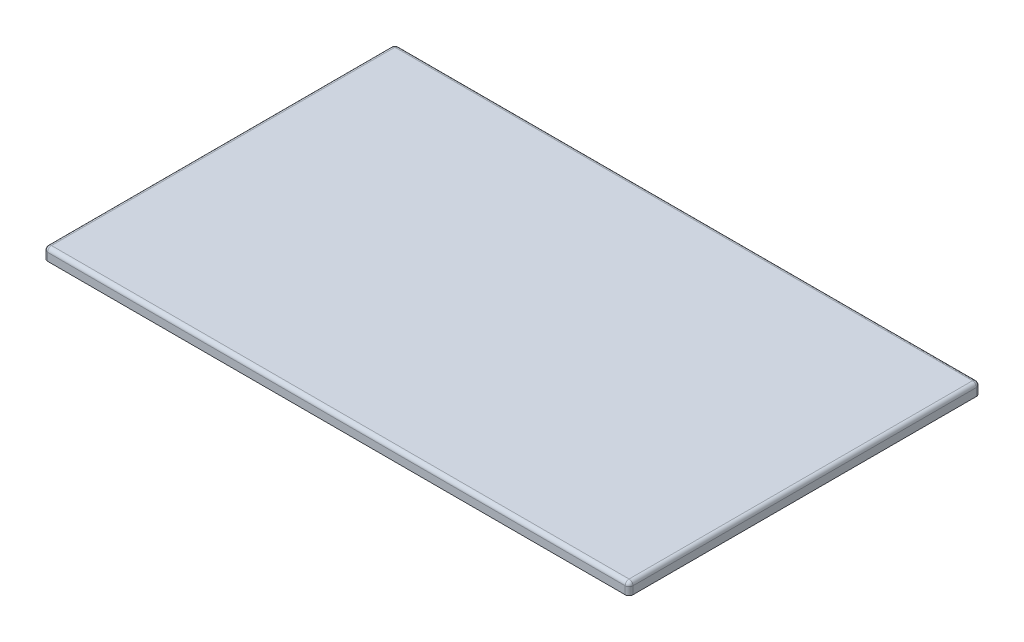
ISO-10303-21;
HEADER;
FILE_DESCRIPTION(('STEP AP214'),'2;1');
FILE_NAME('part.step','',(''),(''),'','','');
FILE_SCHEMA(('AUTOMOTIVE_DESIGN { 1 0 10303 214 1 1 1 1 }'));
ENDSEC;
DATA;
#1=APPLICATION_CONTEXT('core data for automotive mechanical design processes');
#2=APPLICATION_PROTOCOL_DEFINITION('international standard','automotive_design',2000,#1);
#3=PRODUCT_CONTEXT('',#1,'mechanical');
#4=PRODUCT('Part','Part','',(#3));
#5=PRODUCT_RELATED_PRODUCT_CATEGORY('part','',(#4));
#6=PRODUCT_DEFINITION_FORMATION('','',#4);
#7=PRODUCT_DEFINITION_CONTEXT('part definition',#1,'design');
#8=PRODUCT_DEFINITION('design','',#6,#7);
#9=PRODUCT_DEFINITION_SHAPE('','',#8);
#10=(LENGTH_UNIT() NAMED_UNIT(*) SI_UNIT(.MILLI.,.METRE.));
#11=(NAMED_UNIT(*) PLANE_ANGLE_UNIT() SI_UNIT($,.RADIAN.));
#12=(NAMED_UNIT(*) SI_UNIT($,.STERADIAN.) SOLID_ANGLE_UNIT());
#13=UNCERTAINTY_MEASURE_WITH_UNIT(LENGTH_MEASURE(1.E-05),#10,'distance_accuracy_value','');
#14=(GEOMETRIC_REPRESENTATION_CONTEXT(3) GLOBAL_UNCERTAINTY_ASSIGNED_CONTEXT((#13)) GLOBAL_UNIT_ASSIGNED_CONTEXT((#10,
#11,#12)) REPRESENTATION_CONTEXT('',''));
#15=CARTESIAN_POINT('',(0.,0.,0.));
#16=DIRECTION('',(0.,0.,1.));
#17=DIRECTION('',(1.,0.,0.));
#18=AXIS2_PLACEMENT_3D('',#15,#16,#17);
#19=CARTESIAN_POINT('',(0.,30.,0.));
#20=DIRECTION('',(1.,0.,0.));
#21=DIRECTION('',(0.,0.,-1.));
#22=AXIS2_PLACEMENT_3D('',#19,#20,#21);
#23=PLANE('',#22);
#24=DIRECTION('',(0.,0.,1.));
#25=VECTOR('',#24,1.);
#26=CARTESIAN_POINT('',(0.,20.,0.));
#27=LINE('',#26,#25);
#28=CARTESIAN_POINT('',(0.,20.,-10.));
#29=VERTEX_POINT('',#28);
#30=CARTESIAN_POINT('',(0.,20.,-890.));
#31=VERTEX_POINT('',#30);
#32=EDGE_CURVE('E442',#29,#31,#27,.F.);
#33=ORIENTED_EDGE('',*,*,#32,.T.);
#34=DIRECTION('',(0.,-1.,0.));
#35=VECTOR('',#34,1.);
#36=CARTESIAN_POINT('',(0.,30.,-890.));
#37=LINE('',#36,#35);
#38=CARTESIAN_POINT('',(0.,0.,-890.));
#39=VERTEX_POINT('',#38);
#40=EDGE_CURVE('E477',#31,#39,#37,.T.);
#41=ORIENTED_EDGE('',*,*,#40,.T.);
#42=DIRECTION('',(0.,0.,1.));
#43=VECTOR('',#42,1.);
#44=CARTESIAN_POINT('',(0.,0.,0.));
#45=LINE('',#44,#43);
#46=CARTESIAN_POINT('',(0.,0.,-10.));
#47=VERTEX_POINT('',#46);
#48=EDGE_CURVE('E397',#39,#47,#45,.T.);
#49=ORIENTED_EDGE('',*,*,#48,.T.);
#50=DIRECTION('',(0.,-1.,0.));
#51=VECTOR('',#50,1.);
#52=CARTESIAN_POINT('',(0.,30.,-10.));
#53=LINE('',#52,#51);
#54=EDGE_CURVE('E474',#47,#29,#53,.F.);
#55=ORIENTED_EDGE('',*,*,#54,.T.);
#56=EDGE_LOOP('',(#33,#41,#49,#55));
#57=FACE_BOUND('',#56,.T.);
#58=ADVANCED_FACE('F40',(#57),#23,.F.);
#59=CARTESIAN_POINT('',(0.,30.,0.));
#60=DIRECTION('',(0.,0.,-1.));
#61=DIRECTION('',(-1.,0.,0.));
#62=AXIS2_PLACEMENT_3D('',#59,#60,#61);
#63=PLANE('',#62);
#64=DIRECTION('',(1.,0.,0.));
#65=VECTOR('',#64,1.);
#66=CARTESIAN_POINT('',(0.,0.,0.));
#67=LINE('',#66,#65);
#68=CARTESIAN_POINT('',(10.,0.,0.));
#69=VERTEX_POINT('',#68);
#70=CARTESIAN_POINT('',(1490.,0.,0.));
#71=VERTEX_POINT('',#70);
#72=EDGE_CURVE('E401',#69,#71,#67,.T.);
#73=ORIENTED_EDGE('',*,*,#72,.T.);
#74=DIRECTION('',(0.,-1.,0.));
#75=VECTOR('',#74,1.);
#76=CARTESIAN_POINT('',(1490.,30.,0.));
#77=LINE('',#76,#75);
#78=CARTESIAN_POINT('',(1490.,20.,0.));
#79=VERTEX_POINT('',#78);
#80=EDGE_CURVE('E11',#71,#79,#77,.F.);
#81=ORIENTED_EDGE('',*,*,#80,.T.);
#82=DIRECTION('',(1.,0.,0.));
#83=VECTOR('',#82,1.);
#84=CARTESIAN_POINT('',(0.,20.,0.));
#85=LINE('',#84,#83);
#86=CARTESIAN_POINT('',(10.,20.,0.));
#87=VERTEX_POINT('',#86);
#88=EDGE_CURVE('E438',#79,#87,#85,.F.);
#89=ORIENTED_EDGE('',*,*,#88,.T.);
#90=DIRECTION('',(0.,-1.,0.));
#91=VECTOR('',#90,1.);
#92=CARTESIAN_POINT('',(10.,30.,0.));
#93=LINE('',#92,#91);
#94=EDGE_CURVE('E50',#87,#69,#93,.T.);
#95=ORIENTED_EDGE('',*,*,#94,.T.);
#96=EDGE_LOOP('',(#73,#81,#89,#95));
#97=FACE_BOUND('',#96,.T.);
#98=ADVANCED_FACE('F530',(#97),#63,.F.);
#99=CARTESIAN_POINT('',(1500.,30.,0.));
#100=DIRECTION('',(-1.,0.,0.));
#101=DIRECTION('',(0.,0.,1.));
#102=AXIS2_PLACEMENT_3D('',#99,#100,#101);
#103=PLANE('',#102);
#104=DIRECTION('',(0.,0.,-1.));
#105=VECTOR('',#104,1.);
#106=CARTESIAN_POINT('',(1500.,0.,0.));
#107=LINE('',#106,#105);
#108=CARTESIAN_POINT('',(1500.,0.,-10.));
#109=VERTEX_POINT('',#108);
#110=CARTESIAN_POINT('',(1500.,0.,-890.));
#111=VERTEX_POINT('',#110);
#112=EDGE_CURVE('E406',#109,#111,#107,.T.);
#113=ORIENTED_EDGE('',*,*,#112,.T.);
#114=DIRECTION('',(0.,-1.,0.));
#115=VECTOR('',#114,1.);
#116=CARTESIAN_POINT('',(1500.,30.,-890.));
#117=LINE('',#116,#115);
#118=CARTESIAN_POINT('',(1500.,20.,-890.));
#119=VERTEX_POINT('',#118);
#120=EDGE_CURVE('E501',#111,#119,#117,.F.);
#121=ORIENTED_EDGE('',*,*,#120,.T.);
#122=DIRECTION('',(0.,0.,-1.));
#123=VECTOR('',#122,1.);
#124=CARTESIAN_POINT('',(1500.,20.,0.));
#125=LINE('',#124,#123);
#126=CARTESIAN_POINT('',(1500.,20.,-10.));
#127=VERTEX_POINT('',#126);
#128=EDGE_CURVE('E434',#119,#127,#125,.F.);
#129=ORIENTED_EDGE('',*,*,#128,.T.);
#130=DIRECTION('',(0.,-1.,0.));
#131=VECTOR('',#130,1.);
#132=CARTESIAN_POINT('',(1500.,30.,-10.));
#133=LINE('',#132,#131);
#134=EDGE_CURVE('E498',#127,#109,#133,.T.);
#135=ORIENTED_EDGE('',*,*,#134,.T.);
#136=EDGE_LOOP('',(#113,#121,#129,#135));
#137=FACE_BOUND('',#136,.T.);
#138=ADVANCED_FACE('F550',(#137),#103,.F.);
#139=CARTESIAN_POINT('',(0.,30.,-900.));
#140=DIRECTION('',(0.,0.,1.));
#141=DIRECTION('',(1.,0.,0.));
#142=AXIS2_PLACEMENT_3D('',#139,#140,#141);
#143=PLANE('',#142);
#144=DIRECTION('',(-1.,0.,0.));
#145=VECTOR('',#144,1.);
#146=CARTESIAN_POINT('',(0.,0.,-900.));
#147=LINE('',#146,#145);
#148=CARTESIAN_POINT('',(1490.,0.,-900.));
#149=VERTEX_POINT('',#148);
#150=CARTESIAN_POINT('',(10.,0.,-900.));
#151=VERTEX_POINT('',#150);
#152=EDGE_CURVE('E410',#149,#151,#147,.T.);
#153=ORIENTED_EDGE('',*,*,#152,.T.);
#154=DIRECTION('',(0.,-1.,0.));
#155=VECTOR('',#154,1.);
#156=CARTESIAN_POINT('',(10.,30.,-900.));
#157=LINE('',#156,#155);
#158=CARTESIAN_POINT('',(10.,20.,-900.));
#159=VERTEX_POINT('',#158);
#160=EDGE_CURVE('E495',#151,#159,#157,.F.);
#161=ORIENTED_EDGE('',*,*,#160,.T.);
#162=DIRECTION('',(-1.,0.,0.));
#163=VECTOR('',#162,1.);
#164=CARTESIAN_POINT('',(0.,20.,-900.));
#165=LINE('',#164,#163);
#166=CARTESIAN_POINT('',(1490.,20.,-900.));
#167=VERTEX_POINT('',#166);
#168=EDGE_CURVE('E430',#159,#167,#165,.F.);
#169=ORIENTED_EDGE('',*,*,#168,.T.);
#170=DIRECTION('',(0.,-1.,0.));
#171=VECTOR('',#170,1.);
#172=CARTESIAN_POINT('',(1490.,30.,-900.));
#173=LINE('',#172,#171);
#174=EDGE_CURVE('E492',#167,#149,#173,.T.);
#175=ORIENTED_EDGE('',*,*,#174,.T.);
#176=EDGE_LOOP('',(#153,#161,#169,#175));
#177=FACE_BOUND('',#176,.T.);
#178=ADVANCED_FACE('F611',(#177),#143,.F.);
#179=CARTESIAN_POINT('',(0.,30.,0.));
#180=DIRECTION('',(0.,-1.,0.));
#181=DIRECTION('',(0.,0.,-1.));
#182=AXIS2_PLACEMENT_3D('',#179,#180,#181);
#183=PLANE('',#182);
#184=DIRECTION('',(0.,0.,-1.));
#185=VECTOR('',#184,1.);
#186=CARTESIAN_POINT('',(1490.,30.,0.));
#187=LINE('',#186,#185);
#188=CARTESIAN_POINT('',(1490.,30.,-10.));
#189=VERTEX_POINT('',#188);
#190=CARTESIAN_POINT('',(1490.,30.,-890.));
#191=VERTEX_POINT('',#190);
#192=EDGE_CURVE('E422',#189,#191,#187,.T.);
#193=ORIENTED_EDGE('',*,*,#192,.T.);
#194=DIRECTION('',(-1.,0.,0.));
#195=VECTOR('',#194,1.);
#196=CARTESIAN_POINT('',(0.,30.,-890.));
#197=LINE('',#196,#195);
#198=CARTESIAN_POINT('',(10.,30.,-890.));
#199=VERTEX_POINT('',#198);
#200=EDGE_CURVE('E426',#191,#199,#197,.T.);
#201=ORIENTED_EDGE('',*,*,#200,.T.);
#202=DIRECTION('',(0.,0.,1.));
#203=VECTOR('',#202,1.);
#204=CARTESIAN_POINT('',(10.,30.,0.));
#205=LINE('',#204,#203);
#206=CARTESIAN_POINT('',(10.,30.,-10.));
#207=VERTEX_POINT('',#206);
#208=EDGE_CURVE('E414',#199,#207,#205,.T.);
#209=ORIENTED_EDGE('',*,*,#208,.T.);
#210=DIRECTION('',(1.,0.,0.));
#211=VECTOR('',#210,1.);
#212=CARTESIAN_POINT('',(0.,30.,-10.));
#213=LINE('',#212,#211);
#214=EDGE_CURVE('E418',#207,#189,#213,.T.);
#215=ORIENTED_EDGE('',*,*,#214,.T.);
#216=EDGE_LOOP('',(#193,#201,#209,#215));
#217=FACE_BOUND('',#216,.T.);
#218=ADVANCED_FACE('F562',(#217),#183,.F.);
#219=CARTESIAN_POINT('',(0.,0.,0.));
#220=DIRECTION('',(0.,-1.,0.));
#221=DIRECTION('',(0.,0.,-1.));
#222=AXIS2_PLACEMENT_3D('',#219,#220,#221);
#223=PLANE('',#222);
#224=CARTESIAN_POINT('',(100.,0.,-800.));
#225=DIRECTION('',(0.,-1.,0.));
#226=DIRECTION('',(0.,0.,1.));
#227=AXIS2_PLACEMENT_3D('',#224,#225,#226);
#228=CIRCLE('',#227,10.);
#229=CARTESIAN_POINT('',(100.,0.,-790.));
#230=VERTEX_POINT('',#229);
#231=CARTESIAN_POINT('',(100.,0.,-810.));
#232=VERTEX_POINT('',#231);
#233=EDGE_CURVE('E58',#230,#232,#228,.T.);
#234=ORIENTED_EDGE('',*,*,#233,.F.);
#235=DIRECTION('',(-1.,0.,0.));
#236=VECTOR('',#235,1.);
#237=CARTESIAN_POINT('',(100.,0.,-790.));
#238=LINE('',#237,#236);
#239=CARTESIAN_POINT('',(150.,0.,-790.));
#240=VERTEX_POINT('',#239);
#241=EDGE_CURVE('E318',#240,#230,#238,.T.);
#242=ORIENTED_EDGE('',*,*,#241,.F.);
#243=CARTESIAN_POINT('',(150.,0.,-800.));
#244=DIRECTION('',(0.,-1.,0.));
#245=DIRECTION('',(0.,0.,1.));
#246=AXIS2_PLACEMENT_3D('',#243,#244,#245);
#247=CIRCLE('',#246,10.);
#248=CARTESIAN_POINT('',(150.,0.,-810.));
#249=VERTEX_POINT('',#248);
#250=EDGE_CURVE('E337',#249,#240,#247,.T.);
#251=ORIENTED_EDGE('',*,*,#250,.F.);
#252=DIRECTION('',(1.,0.,0.));
#253=VECTOR('',#252,1.);
#254=CARTESIAN_POINT('',(100.,0.,-810.));
#255=LINE('',#254,#253);
#256=EDGE_CURVE('E333',#232,#249,#255,.T.);
#257=ORIENTED_EDGE('',*,*,#256,.F.);
#258=EDGE_LOOP('',(#234,#242,#251,#257));
#259=FACE_BOUND('',#258,.T.);
#260=CARTESIAN_POINT('',(1400.,0.,-800.));
#261=DIRECTION('',(0.,-1.,0.));
#262=DIRECTION('',(0.,0.,-1.));
#263=AXIS2_PLACEMENT_3D('',#260,#261,#262);
#264=CIRCLE('',#263,10.);
#265=CARTESIAN_POINT('',(1400.,0.,-810.));
#266=VERTEX_POINT('',#265);
#267=CARTESIAN_POINT('',(1400.,0.,-790.));
#268=VERTEX_POINT('',#267);
#269=EDGE_CURVE('E66',#266,#268,#264,.T.);
#270=ORIENTED_EDGE('',*,*,#269,.F.);
#271=DIRECTION('',(1.,0.,0.));
#272=VECTOR('',#271,1.);
#273=CARTESIAN_POINT('',(1400.,0.,-810.));
#274=LINE('',#273,#272);
#275=CARTESIAN_POINT('',(1350.,0.,-810.));
#276=VERTEX_POINT('',#275);
#277=EDGE_CURVE('E276',#276,#266,#274,.T.);
#278=ORIENTED_EDGE('',*,*,#277,.F.);
#279=CARTESIAN_POINT('',(1350.,0.,-800.));
#280=DIRECTION('',(0.,-1.,0.));
#281=DIRECTION('',(0.,0.,-1.));
#282=AXIS2_PLACEMENT_3D('',#279,#280,#281);
#283=CIRCLE('',#282,10.);
#284=CARTESIAN_POINT('',(1350.,0.,-790.));
#285=VERTEX_POINT('',#284);
#286=EDGE_CURVE('E296',#285,#276,#283,.T.);
#287=ORIENTED_EDGE('',*,*,#286,.F.);
#288=DIRECTION('',(-1.,0.,0.));
#289=VECTOR('',#288,1.);
#290=CARTESIAN_POINT('',(1400.,0.,-790.));
#291=LINE('',#290,#289);
#292=EDGE_CURVE('E291',#268,#285,#291,.T.);
#293=ORIENTED_EDGE('',*,*,#292,.F.);
#294=EDGE_LOOP('',(#270,#278,#287,#293));
#295=FACE_BOUND('',#294,.T.);
#296=CARTESIAN_POINT('',(1400.,0.,-100.));
#297=DIRECTION('',(0.,-1.,0.));
#298=DIRECTION('',(0.,0.,1.));
#299=AXIS2_PLACEMENT_3D('',#296,#297,#298);
#300=CIRCLE('',#299,10.);
#301=CARTESIAN_POINT('',(1400.,0.,-110.));
#302=VERTEX_POINT('',#301);
#303=CARTESIAN_POINT('',(1400.,0.,-90.));
#304=VERTEX_POINT('',#303);
#305=EDGE_CURVE('E222',#302,#304,#300,.T.);
#306=ORIENTED_EDGE('',*,*,#305,.F.);
#307=DIRECTION('',(1.,0.,0.));
#308=VECTOR('',#307,1.);
#309=CARTESIAN_POINT('',(1400.,0.,-110.));
#310=LINE('',#309,#308);
#311=CARTESIAN_POINT('',(1350.,0.,-110.));
#312=VERTEX_POINT('',#311);
#313=EDGE_CURVE('E242',#312,#302,#310,.T.);
#314=ORIENTED_EDGE('',*,*,#313,.F.);
#315=CARTESIAN_POINT('',(1350.,0.,-100.));
#316=DIRECTION('',(0.,-1.,0.));
#317=DIRECTION('',(0.,0.,1.));
#318=AXIS2_PLACEMENT_3D('',#315,#316,#317);
#319=CIRCLE('',#318,10.);
#320=CARTESIAN_POINT('',(1350.,0.,-90.));
#321=VERTEX_POINT('',#320);
#322=EDGE_CURVE('E246',#321,#312,#319,.T.);
#323=ORIENTED_EDGE('',*,*,#322,.F.);
#324=DIRECTION('',(-1.,0.,0.));
#325=VECTOR('',#324,1.);
#326=CARTESIAN_POINT('',(1400.,0.,-90.));
#327=LINE('',#326,#325);
#328=EDGE_CURVE('E255',#304,#321,#327,.T.);
#329=ORIENTED_EDGE('',*,*,#328,.F.);
#330=EDGE_LOOP('',(#306,#314,#323,#329));
#331=FACE_BOUND('',#330,.T.);
#332=CARTESIAN_POINT('',(100.,0.,-100.));
#333=DIRECTION('',(0.,-1.,0.));
#334=DIRECTION('',(0.,0.,-1.));
#335=AXIS2_PLACEMENT_3D('',#332,#333,#334);
#336=CIRCLE('',#335,10.);
#337=CARTESIAN_POINT('',(100.,0.,-90.));
#338=VERTEX_POINT('',#337);
#339=CARTESIAN_POINT('',(100.,0.,-110.));
#340=VERTEX_POINT('',#339);
#341=EDGE_CURVE('E265',#338,#340,#336,.T.);
#342=ORIENTED_EDGE('',*,*,#341,.F.);
#343=DIRECTION('',(-1.,0.,0.));
#344=VECTOR('',#343,1.);
#345=CARTESIAN_POINT('',(100.,0.,-90.));
#346=LINE('',#345,#344);
#347=CARTESIAN_POINT('',(150.,0.,-90.));
#348=VERTEX_POINT('',#347);
#349=EDGE_CURVE('E359',#348,#338,#346,.T.);
#350=ORIENTED_EDGE('',*,*,#349,.F.);
#351=CARTESIAN_POINT('',(150.,0.,-100.));
#352=DIRECTION('',(0.,-1.,0.));
#353=DIRECTION('',(0.,0.,-1.));
#354=AXIS2_PLACEMENT_3D('',#351,#352,#353);
#355=CIRCLE('',#354,10.);
#356=CARTESIAN_POINT('',(150.,0.,-110.));
#357=VERTEX_POINT('',#356);
#358=EDGE_CURVE('E378',#357,#348,#355,.T.);
#359=ORIENTED_EDGE('',*,*,#358,.F.);
#360=DIRECTION('',(1.,0.,0.));
#361=VECTOR('',#360,1.);
#362=CARTESIAN_POINT('',(100.,0.,-110.));
#363=LINE('',#362,#361);
#364=EDGE_CURVE('E374',#340,#357,#363,.T.);
#365=ORIENTED_EDGE('',*,*,#364,.F.);
#366=EDGE_LOOP('',(#342,#350,#359,#365));
#367=FACE_BOUND('',#366,.T.);
#368=ORIENTED_EDGE('',*,*,#48,.F.);
#369=CARTESIAN_POINT('',(10.,0.,-890.));
#370=DIRECTION('',(0.,-1.,0.));
#371=DIRECTION('',(0.,0.,-1.));
#372=AXIS2_PLACEMENT_3D('',#369,#370,#371);
#373=CIRCLE('',#372,10.);
#374=EDGE_CURVE('E489',#39,#151,#373,.T.);
#375=ORIENTED_EDGE('',*,*,#374,.T.);
#376=ORIENTED_EDGE('',*,*,#152,.F.);
#377=CARTESIAN_POINT('',(1490.,0.,-890.));
#378=DIRECTION('',(0.,-1.,0.));
#379=DIRECTION('',(0.,0.,-1.));
#380=AXIS2_PLACEMENT_3D('',#377,#378,#379);
#381=CIRCLE('',#380,10.);
#382=EDGE_CURVE('E486',#149,#111,#381,.T.);
#383=ORIENTED_EDGE('',*,*,#382,.T.);
#384=ORIENTED_EDGE('',*,*,#112,.F.);
#385=CARTESIAN_POINT('',(1490.,0.,-10.));
#386=DIRECTION('',(0.,-1.,0.));
#387=DIRECTION('',(0.,0.,-1.));
#388=AXIS2_PLACEMENT_3D('',#385,#386,#387);
#389=CIRCLE('',#388,10.);
#390=EDGE_CURVE('E483',#109,#71,#389,.T.);
#391=ORIENTED_EDGE('',*,*,#390,.T.);
#392=ORIENTED_EDGE('',*,*,#72,.F.);
#393=CARTESIAN_POINT('',(10.,0.,-10.));
#394=DIRECTION('',(0.,-1.,0.));
#395=DIRECTION('',(0.,0.,-1.));
#396=AXIS2_PLACEMENT_3D('',#393,#394,#395);
#397=CIRCLE('',#396,10.);
#398=EDGE_CURVE('E480',#69,#47,#397,.T.);
#399=ORIENTED_EDGE('',*,*,#398,.T.);
#400=EDGE_LOOP('',(#368,#375,#376,#383,#384,#391,#392,#399));
#401=FACE_BOUND('',#400,.T.);
#402=ADVANCED_FACE('F535',(#259,#295,#331,#367,#401),#223,.T.);
#403=CARTESIAN_POINT('',(0.,20.,-10.));
#404=DIRECTION('',(1.,0.,0.));
#405=DIRECTION('',(0.,0.,-1.));
#406=AXIS2_PLACEMENT_3D('',#403,#404,#405);
#407=CYLINDRICAL_SURFACE('',#406,10.);
#408=ORIENTED_EDGE('',*,*,#88,.F.);
#409=CARTESIAN_POINT('',(1490.,20.,-10.));
#410=DIRECTION('',(1.,0.,0.));
#411=DIRECTION('',(0.,0.,-1.));
#412=AXIS2_PLACEMENT_3D('',#409,#410,#411);
#413=CIRCLE('',#412,10.);
#414=EDGE_CURVE('E471',#79,#189,#413,.F.);
#415=ORIENTED_EDGE('',*,*,#414,.T.);
#416=ORIENTED_EDGE('',*,*,#214,.F.);
#417=CARTESIAN_POINT('',(10.,20.,-10.));
#418=DIRECTION('',(1.,0.,0.));
#419=DIRECTION('',(0.,0.,-1.));
#420=AXIS2_PLACEMENT_3D('',#417,#418,#419);
#421=CIRCLE('',#420,10.);
#422=EDGE_CURVE('E468',#207,#87,#421,.T.);
#423=ORIENTED_EDGE('',*,*,#422,.T.);
#424=EDGE_LOOP('',(#408,#415,#416,#423));
#425=FACE_BOUND('',#424,.T.);
#426=ADVANCED_FACE('F541',(#425),#407,.T.);
#427=CARTESIAN_POINT('',(1490.,20.,0.));
#428=DIRECTION('',(0.,0.,-1.));
#429=DIRECTION('',(-1.,0.,0.));
#430=AXIS2_PLACEMENT_3D('',#427,#428,#429);
#431=CYLINDRICAL_SURFACE('',#430,10.);
#432=ORIENTED_EDGE('',*,*,#128,.F.);
#433=CARTESIAN_POINT('',(1490.,20.,-890.));
#434=DIRECTION('',(0.,0.,-1.));
#435=DIRECTION('',(-1.,0.,0.));
#436=AXIS2_PLACEMENT_3D('',#433,#434,#435);
#437=CIRCLE('',#436,10.);
#438=EDGE_CURVE('E465',#119,#191,#437,.F.);
#439=ORIENTED_EDGE('',*,*,#438,.T.);
#440=ORIENTED_EDGE('',*,*,#192,.F.);
#441=CARTESIAN_POINT('',(1490.,20.,-10.));
#442=DIRECTION('',(0.,0.,-1.));
#443=DIRECTION('',(-1.,0.,0.));
#444=AXIS2_PLACEMENT_3D('',#441,#442,#443);
#445=CIRCLE('',#444,10.);
#446=EDGE_CURVE('E461',#189,#127,#445,.T.);
#447=ORIENTED_EDGE('',*,*,#446,.T.);
#448=EDGE_LOOP('',(#432,#439,#440,#447));
#449=FACE_BOUND('',#448,.T.);
#450=ADVANCED_FACE('F547',(#449),#431,.T.);
#451=CARTESIAN_POINT('',(10.,20.,0.));
#452=DIRECTION('',(0.,0.,1.));
#453=DIRECTION('',(1.,0.,0.));
#454=AXIS2_PLACEMENT_3D('',#451,#452,#453);
#455=CYLINDRICAL_SURFACE('',#454,10.);
#456=ORIENTED_EDGE('',*,*,#208,.F.);
#457=CARTESIAN_POINT('',(10.,20.,-890.));
#458=DIRECTION('',(0.,0.,1.));
#459=DIRECTION('',(1.,0.,0.));
#460=AXIS2_PLACEMENT_3D('',#457,#458,#459);
#461=CIRCLE('',#460,10.);
#462=EDGE_CURVE('E458',#199,#31,#461,.T.);
#463=ORIENTED_EDGE('',*,*,#462,.T.);
#464=ORIENTED_EDGE('',*,*,#32,.F.);
#465=CARTESIAN_POINT('',(10.,20.,-10.));
#466=DIRECTION('',(0.,0.,1.));
#467=DIRECTION('',(1.,0.,0.));
#468=AXIS2_PLACEMENT_3D('',#465,#466,#467);
#469=CIRCLE('',#468,10.);
#470=EDGE_CURVE('E454',#29,#207,#469,.F.);
#471=ORIENTED_EDGE('',*,*,#470,.T.);
#472=EDGE_LOOP('',(#456,#463,#464,#471));
#473=FACE_BOUND('',#472,.T.);
#474=ADVANCED_FACE('F571',(#473),#455,.T.);
#475=CARTESIAN_POINT('',(0.,20.,-890.));
#476=DIRECTION('',(-1.,0.,0.));
#477=DIRECTION('',(0.,0.,1.));
#478=AXIS2_PLACEMENT_3D('',#475,#476,#477);
#479=CYLINDRICAL_SURFACE('',#478,10.);
#480=ORIENTED_EDGE('',*,*,#168,.F.);
#481=CARTESIAN_POINT('',(10.,20.,-890.));
#482=DIRECTION('',(-1.,0.,0.));
#483=DIRECTION('',(0.,0.,1.));
#484=AXIS2_PLACEMENT_3D('',#481,#482,#483);
#485=CIRCLE('',#484,10.);
#486=EDGE_CURVE('E450',#159,#199,#485,.F.);
#487=ORIENTED_EDGE('',*,*,#486,.T.);
#488=ORIENTED_EDGE('',*,*,#200,.F.);
#489=CARTESIAN_POINT('',(1490.,20.,-890.));
#490=DIRECTION('',(-1.,0.,0.));
#491=DIRECTION('',(0.,0.,1.));
#492=AXIS2_PLACEMENT_3D('',#489,#490,#491);
#493=CIRCLE('',#492,10.);
#494=EDGE_CURVE('E446',#191,#167,#493,.T.);
#495=ORIENTED_EDGE('',*,*,#494,.T.);
#496=EDGE_LOOP('',(#480,#487,#488,#495));
#497=FACE_BOUND('',#496,.T.);
#498=ADVANCED_FACE('F565',(#497),#479,.T.);
#499=CARTESIAN_POINT('',(10.,30.,-890.));
#500=DIRECTION('',(0.,-1.,0.));
#501=DIRECTION('',(0.,0.,-1.));
#502=AXIS2_PLACEMENT_3D('',#499,#500,#501);
#503=CYLINDRICAL_SURFACE('',#502,10.);
#504=ORIENTED_EDGE('',*,*,#374,.F.);
#505=ORIENTED_EDGE('',*,*,#40,.F.);
#506=CARTESIAN_POINT('',(10.,20.,-890.));
#507=DIRECTION('',(0.,1.,0.));
#508=DIRECTION('',(0.,0.,1.));
#509=AXIS2_PLACEMENT_3D('',#506,#507,#508);
#510=CIRCLE('',#509,10.);
#511=EDGE_CURVE('E402',#159,#31,#510,.T.);
#512=ORIENTED_EDGE('',*,*,#511,.F.);
#513=ORIENTED_EDGE('',*,*,#160,.F.);
#514=EDGE_LOOP('',(#504,#505,#512,#513));
#515=FACE_BOUND('',#514,.T.);
#516=ADVANCED_FACE('F577',(#515),#503,.T.);
#517=CARTESIAN_POINT('',(10.,20.,-890.));
#518=DIRECTION('',(0.,0.,1.));
#519=DIRECTION('',(1.,0.,0.));
#520=AXIS2_PLACEMENT_3D('',#517,#518,#519);
#521=SPHERICAL_SURFACE('',#520,10.);
#522=ORIENTED_EDGE('',*,*,#511,.T.);
#523=ORIENTED_EDGE('',*,*,#462,.F.);
#524=ORIENTED_EDGE('',*,*,#486,.F.);
#525=EDGE_LOOP('',(#522,#523,#524));
#526=FACE_BOUND('',#525,.T.);
#527=ADVANCED_FACE('F579',(#526),#521,.T.);
#528=CARTESIAN_POINT('',(1490.,30.,-890.));
#529=DIRECTION('',(0.,-1.,0.));
#530=DIRECTION('',(0.,0.,-1.));
#531=AXIS2_PLACEMENT_3D('',#528,#529,#530);
#532=CYLINDRICAL_SURFACE('',#531,10.);
#533=ORIENTED_EDGE('',*,*,#382,.F.);
#534=ORIENTED_EDGE('',*,*,#174,.F.);
#535=CARTESIAN_POINT('',(1490.,20.,-890.));
#536=DIRECTION('',(0.,1.,0.));
#537=DIRECTION('',(0.,0.,1.));
#538=AXIS2_PLACEMENT_3D('',#535,#536,#537);
#539=CIRCLE('',#538,10.);
#540=EDGE_CURVE('E509',#119,#167,#539,.T.);
#541=ORIENTED_EDGE('',*,*,#540,.F.);
#542=ORIENTED_EDGE('',*,*,#120,.F.);
#543=EDGE_LOOP('',(#533,#534,#541,#542));
#544=FACE_BOUND('',#543,.T.);
#545=ADVANCED_FACE('F555',(#544),#532,.T.);
#546=CARTESIAN_POINT('',(1490.,20.,-890.));
#547=DIRECTION('',(0.,0.,1.));
#548=DIRECTION('',(1.,0.,0.));
#549=AXIS2_PLACEMENT_3D('',#546,#547,#548);
#550=SPHERICAL_SURFACE('',#549,10.);
#551=ORIENTED_EDGE('',*,*,#494,.F.);
#552=ORIENTED_EDGE('',*,*,#438,.F.);
#553=ORIENTED_EDGE('',*,*,#540,.T.);
#554=EDGE_LOOP('',(#551,#552,#553));
#555=FACE_BOUND('',#554,.T.);
#556=ADVANCED_FACE('F559',(#555),#550,.T.);
#557=CARTESIAN_POINT('',(1490.,30.,-10.));
#558=DIRECTION('',(0.,-1.,0.));
#559=DIRECTION('',(0.,0.,-1.));
#560=AXIS2_PLACEMENT_3D('',#557,#558,#559);
#561=CYLINDRICAL_SURFACE('',#560,10.);
#562=ORIENTED_EDGE('',*,*,#390,.F.);
#563=ORIENTED_EDGE('',*,*,#134,.F.);
#564=CARTESIAN_POINT('',(1490.,20.,-10.));
#565=DIRECTION('',(0.,1.,0.));
#566=DIRECTION('',(0.,0.,1.));
#567=AXIS2_PLACEMENT_3D('',#564,#565,#566);
#568=CIRCLE('',#567,10.);
#569=EDGE_CURVE('E511',#79,#127,#568,.T.);
#570=ORIENTED_EDGE('',*,*,#569,.F.);
#571=ORIENTED_EDGE('',*,*,#80,.F.);
#572=EDGE_LOOP('',(#562,#563,#570,#571));
#573=FACE_BOUND('',#572,.T.);
#574=ADVANCED_FACE('F539',(#573),#561,.T.);
#575=CARTESIAN_POINT('',(1490.,20.,-10.));
#576=DIRECTION('',(0.,0.,1.));
#577=DIRECTION('',(1.,0.,0.));
#578=AXIS2_PLACEMENT_3D('',#575,#576,#577);
#579=SPHERICAL_SURFACE('',#578,10.);
#580=ORIENTED_EDGE('',*,*,#446,.F.);
#581=ORIENTED_EDGE('',*,*,#414,.F.);
#582=ORIENTED_EDGE('',*,*,#569,.T.);
#583=EDGE_LOOP('',(#580,#581,#582));
#584=FACE_BOUND('',#583,.T.);
#585=ADVANCED_FACE('F543',(#584),#579,.T.);
#586=CARTESIAN_POINT('',(10.,30.,-10.));
#587=DIRECTION('',(0.,-1.,0.));
#588=DIRECTION('',(0.,0.,-1.));
#589=AXIS2_PLACEMENT_3D('',#586,#587,#588);
#590=CYLINDRICAL_SURFACE('',#589,10.);
#591=ORIENTED_EDGE('',*,*,#398,.F.);
#592=ORIENTED_EDGE('',*,*,#94,.F.);
#593=CARTESIAN_POINT('',(10.,20.,-10.));
#594=DIRECTION('',(0.,1.,0.));
#595=DIRECTION('',(0.,0.,1.));
#596=AXIS2_PLACEMENT_3D('',#593,#594,#595);
#597=CIRCLE('',#596,10.);
#598=EDGE_CURVE('E44',#29,#87,#597,.T.);
#599=ORIENTED_EDGE('',*,*,#598,.F.);
#600=ORIENTED_EDGE('',*,*,#54,.F.);
#601=EDGE_LOOP('',(#591,#592,#599,#600));
#602=FACE_BOUND('',#601,.T.);
#603=ADVANCED_FACE('F42',(#602),#590,.T.);
#604=CARTESIAN_POINT('',(10.,20.,-10.));
#605=DIRECTION('',(0.,0.,1.));
#606=DIRECTION('',(1.,0.,0.));
#607=AXIS2_PLACEMENT_3D('',#604,#605,#606);
#608=SPHERICAL_SURFACE('',#607,10.);
#609=ORIENTED_EDGE('',*,*,#598,.T.);
#610=ORIENTED_EDGE('',*,*,#422,.F.);
#611=ORIENTED_EDGE('',*,*,#470,.F.);
#612=EDGE_LOOP('',(#609,#610,#611));
#613=FACE_BOUND('',#612,.T.);
#614=ADVANCED_FACE('F523',(#613),#608,.T.);
#615=CARTESIAN_POINT('',(100.,15.,-100.));
#616=DIRECTION('',(0.,-1.,0.));
#617=DIRECTION('',(0.,0.,-1.));
#618=AXIS2_PLACEMENT_3D('',#615,#616,#617);
#619=CYLINDRICAL_SURFACE('',#618,10.);
#620=ORIENTED_EDGE('',*,*,#341,.T.);
#621=DIRECTION('',(0.,-1.,0.));
#622=VECTOR('',#621,1.);
#623=CARTESIAN_POINT('',(100.,15.,-110.));
#624=LINE('',#623,#622);
#625=CARTESIAN_POINT('',(100.,15.,-110.));
#626=VERTEX_POINT('',#625);
#627=EDGE_CURVE('E371',#626,#340,#624,.T.);
#628=ORIENTED_EDGE('',*,*,#627,.F.);
#629=CARTESIAN_POINT('',(100.,15.,-100.));
#630=DIRECTION('',(0.,-1.,0.));
#631=DIRECTION('',(0.,0.,-1.));
#632=AXIS2_PLACEMENT_3D('',#629,#630,#631);
#633=CIRCLE('',#632,10.);
#634=CARTESIAN_POINT('',(100.,15.,-90.));
#635=VERTEX_POINT('',#634);
#636=EDGE_CURVE('E354',#635,#626,#633,.T.);
#637=ORIENTED_EDGE('',*,*,#636,.F.);
#638=DIRECTION('',(0.,-1.,0.));
#639=VECTOR('',#638,1.);
#640=CARTESIAN_POINT('',(100.,15.,-90.));
#641=LINE('',#640,#639);
#642=EDGE_CURVE('E385',#635,#338,#641,.T.);
#643=ORIENTED_EDGE('',*,*,#642,.T.);
#644=EDGE_LOOP('',(#620,#628,#637,#643));
#645=FACE_BOUND('',#644,.T.);
#646=ADVANCED_FACE('F712',(#645),#619,.F.);
#647=CARTESIAN_POINT('',(100.,15.,-90.));
#648=DIRECTION('',(0.,0.,1.));
#649=DIRECTION('',(1.,0.,0.));
#650=AXIS2_PLACEMENT_3D('',#647,#648,#649);
#651=PLANE('',#650);
#652=ORIENTED_EDGE('',*,*,#349,.T.);
#653=ORIENTED_EDGE('',*,*,#642,.F.);
#654=DIRECTION('',(-1.,0.,0.));
#655=VECTOR('',#654,1.);
#656=CARTESIAN_POINT('',(100.,15.,-90.));
#657=LINE('',#656,#655);
#658=CARTESIAN_POINT('',(150.,15.,-90.));
#659=VERTEX_POINT('',#658);
#660=EDGE_CURVE('E367',#659,#635,#657,.T.);
#661=ORIENTED_EDGE('',*,*,#660,.F.);
#662=DIRECTION('',(0.,-1.,0.));
#663=VECTOR('',#662,1.);
#664=CARTESIAN_POINT('',(150.,15.,-90.));
#665=LINE('',#664,#663);
#666=EDGE_CURVE('E388',#659,#348,#665,.T.);
#667=ORIENTED_EDGE('',*,*,#666,.T.);
#668=EDGE_LOOP('',(#652,#653,#661,#667));
#669=FACE_BOUND('',#668,.T.);
#670=ADVANCED_FACE('F725',(#669),#651,.F.);
#671=CARTESIAN_POINT('',(150.,15.,-100.));
#672=DIRECTION('',(0.,-1.,0.));
#673=DIRECTION('',(0.,0.,-1.));
#674=AXIS2_PLACEMENT_3D('',#671,#672,#673);
#675=CYLINDRICAL_SURFACE('',#674,10.);
#676=ORIENTED_EDGE('',*,*,#358,.T.);
#677=ORIENTED_EDGE('',*,*,#666,.F.);
#678=CARTESIAN_POINT('',(150.,15.,-100.));
#679=DIRECTION('',(0.,-1.,0.));
#680=DIRECTION('',(0.,0.,-1.));
#681=AXIS2_PLACEMENT_3D('',#678,#679,#680);
#682=CIRCLE('',#681,10.);
#683=CARTESIAN_POINT('',(150.,15.,-110.));
#684=VERTEX_POINT('',#683);
#685=EDGE_CURVE('E363',#684,#659,#682,.T.);
#686=ORIENTED_EDGE('',*,*,#685,.F.);
#687=DIRECTION('',(0.,-1.,0.));
#688=VECTOR('',#687,1.);
#689=CARTESIAN_POINT('',(150.,15.,-110.));
#690=LINE('',#689,#688);
#691=EDGE_CURVE('E391',#684,#357,#690,.T.);
#692=ORIENTED_EDGE('',*,*,#691,.T.);
#693=EDGE_LOOP('',(#676,#677,#686,#692));
#694=FACE_BOUND('',#693,.T.);
#695=ADVANCED_FACE('F734',(#694),#675,.F.);
#696=CARTESIAN_POINT('',(100.,15.,-110.));
#697=DIRECTION('',(0.,0.,-1.));
#698=DIRECTION('',(-1.,0.,0.));
#699=AXIS2_PLACEMENT_3D('',#696,#697,#698);
#700=PLANE('',#699);
#701=ORIENTED_EDGE('',*,*,#364,.T.);
#702=ORIENTED_EDGE('',*,*,#691,.F.);
#703=DIRECTION('',(1.,0.,0.));
#704=VECTOR('',#703,1.);
#705=CARTESIAN_POINT('',(100.,15.,-110.));
#706=LINE('',#705,#704);
#707=EDGE_CURVE('E358',#626,#684,#706,.T.);
#708=ORIENTED_EDGE('',*,*,#707,.F.);
#709=ORIENTED_EDGE('',*,*,#627,.T.);
#710=EDGE_LOOP('',(#701,#702,#708,#709));
#711=FACE_BOUND('',#710,.T.);
#712=ADVANCED_FACE('F744',(#711),#700,.F.);
#713=CARTESIAN_POINT('',(100.,15.,-100.));
#714=DIRECTION('',(0.,-1.,0.));
#715=DIRECTION('',(0.,0.,-1.));
#716=AXIS2_PLACEMENT_3D('',#713,#714,#715);
#717=PLANE('',#716);
#718=ORIENTED_EDGE('',*,*,#636,.T.);
#719=ORIENTED_EDGE('',*,*,#707,.T.);
#720=ORIENTED_EDGE('',*,*,#685,.T.);
#721=ORIENTED_EDGE('',*,*,#660,.T.);
#722=EDGE_LOOP('',(#718,#719,#720,#721));
#723=FACE_BOUND('',#722,.T.);
#724=ADVANCED_FACE('F754',(#723),#717,.T.);
#725=CARTESIAN_POINT('',(1400.,15.,-100.));
#726=DIRECTION('',(0.,-1.,0.));
#727=DIRECTION('',(0.,0.,-1.));
#728=AXIS2_PLACEMENT_3D('',#725,#726,#727);
#729=CYLINDRICAL_SURFACE('',#728,10.);
#730=ORIENTED_EDGE('',*,*,#305,.T.);
#731=DIRECTION('',(0.,-1.,0.));
#732=VECTOR('',#731,1.);
#733=CARTESIAN_POINT('',(1400.,15.,-90.));
#734=LINE('',#733,#732);
#735=CARTESIAN_POINT('',(1400.,15.,-90.));
#736=VERTEX_POINT('',#735);
#737=EDGE_CURVE('E215',#736,#304,#734,.T.);
#738=ORIENTED_EDGE('',*,*,#737,.F.);
#739=CARTESIAN_POINT('',(1400.,15.,-100.));
#740=DIRECTION('',(0.,-1.,0.));
#741=DIRECTION('',(0.,0.,1.));
#742=AXIS2_PLACEMENT_3D('',#739,#740,#741);
#743=CIRCLE('',#742,10.);
#744=CARTESIAN_POINT('',(1400.,15.,-110.));
#745=VERTEX_POINT('',#744);
#746=EDGE_CURVE('E219',#745,#736,#743,.T.);
#747=ORIENTED_EDGE('',*,*,#746,.F.);
#748=DIRECTION('',(0.,-1.,0.));
#749=VECTOR('',#748,1.);
#750=CARTESIAN_POINT('',(1400.,15.,-110.));
#751=LINE('',#750,#749);
#752=EDGE_CURVE('E262',#745,#302,#751,.T.);
#753=ORIENTED_EDGE('',*,*,#752,.T.);
#754=EDGE_LOOP('',(#730,#738,#747,#753));
#755=FACE_BOUND('',#754,.T.);
#756=ADVANCED_FACE('F217',(#755),#729,.F.);
#757=CARTESIAN_POINT('',(1400.,15.,-110.));
#758=DIRECTION('',(0.,0.,-1.));
#759=DIRECTION('',(-1.,0.,0.));
#760=AXIS2_PLACEMENT_3D('',#757,#758,#759);
#761=PLANE('',#760);
#762=ORIENTED_EDGE('',*,*,#313,.T.);
#763=ORIENTED_EDGE('',*,*,#752,.F.);
#764=DIRECTION('',(1.,0.,0.));
#765=VECTOR('',#764,1.);
#766=CARTESIAN_POINT('',(1400.,15.,-110.));
#767=LINE('',#766,#765);
#768=CARTESIAN_POINT('',(1350.,15.,-110.));
#769=VERTEX_POINT('',#768);
#770=EDGE_CURVE('E228',#769,#745,#767,.T.);
#771=ORIENTED_EDGE('',*,*,#770,.F.);
#772=DIRECTION('',(0.,-1.,0.));
#773=VECTOR('',#772,1.);
#774=CARTESIAN_POINT('',(1350.,15.,-110.));
#775=LINE('',#774,#773);
#776=EDGE_CURVE('E266',#769,#312,#775,.T.);
#777=ORIENTED_EDGE('',*,*,#776,.T.);
#778=EDGE_LOOP('',(#762,#763,#771,#777));
#779=FACE_BOUND('',#778,.T.);
#780=ADVANCED_FACE('F773',(#779),#761,.F.);
#781=CARTESIAN_POINT('',(1350.,15.,-100.));
#782=DIRECTION('',(0.,-1.,0.));
#783=DIRECTION('',(0.,0.,-1.));
#784=AXIS2_PLACEMENT_3D('',#781,#782,#783);
#785=CYLINDRICAL_SURFACE('',#784,10.);
#786=ORIENTED_EDGE('',*,*,#322,.T.);
#787=ORIENTED_EDGE('',*,*,#776,.F.);
#788=CARTESIAN_POINT('',(1350.,15.,-100.));
#789=DIRECTION('',(0.,-1.,0.));
#790=DIRECTION('',(0.,0.,1.));
#791=AXIS2_PLACEMENT_3D('',#788,#789,#790);
#792=CIRCLE('',#791,10.);
#793=CARTESIAN_POINT('',(1350.,15.,-90.));
#794=VERTEX_POINT('',#793);
#795=EDGE_CURVE('E237',#794,#769,#792,.T.);
#796=ORIENTED_EDGE('',*,*,#795,.F.);
#797=DIRECTION('',(0.,-1.,0.));
#798=VECTOR('',#797,1.);
#799=CARTESIAN_POINT('',(1350.,15.,-90.));
#800=LINE('',#799,#798);
#801=EDGE_CURVE('E227',#794,#321,#800,.T.);
#802=ORIENTED_EDGE('',*,*,#801,.T.);
#803=EDGE_LOOP('',(#786,#787,#796,#802));
#804=FACE_BOUND('',#803,.T.);
#805=ADVANCED_FACE('F782',(#804),#785,.F.);
#806=CARTESIAN_POINT('',(1400.,15.,-90.));
#807=DIRECTION('',(0.,0.,1.));
#808=DIRECTION('',(1.,0.,0.));
#809=AXIS2_PLACEMENT_3D('',#806,#807,#808);
#810=PLANE('',#809);
#811=ORIENTED_EDGE('',*,*,#328,.T.);
#812=ORIENTED_EDGE('',*,*,#801,.F.);
#813=DIRECTION('',(-1.,0.,0.));
#814=VECTOR('',#813,1.);
#815=CARTESIAN_POINT('',(1400.,15.,-90.));
#816=LINE('',#815,#814);
#817=EDGE_CURVE('E231',#736,#794,#816,.T.);
#818=ORIENTED_EDGE('',*,*,#817,.F.);
#819=ORIENTED_EDGE('',*,*,#737,.T.);
#820=EDGE_LOOP('',(#811,#812,#818,#819));
#821=FACE_BOUND('',#820,.T.);
#822=ADVANCED_FACE('F232',(#821),#810,.F.);
#823=CARTESIAN_POINT('',(1400.,15.,-100.));
#824=DIRECTION('',(0.,1.,0.));
#825=DIRECTION('',(0.,0.,1.));
#826=AXIS2_PLACEMENT_3D('',#823,#824,#825);
#827=PLANE('',#826);
#828=ORIENTED_EDGE('',*,*,#746,.T.);
#829=ORIENTED_EDGE('',*,*,#817,.T.);
#830=ORIENTED_EDGE('',*,*,#795,.T.);
#831=ORIENTED_EDGE('',*,*,#770,.T.);
#832=EDGE_LOOP('',(#828,#829,#830,#831));
#833=FACE_BOUND('',#832,.T.);
#834=ADVANCED_FACE('F239',(#833),#827,.F.);
#835=CARTESIAN_POINT('',(1400.,15.,-800.));
#836=DIRECTION('',(0.,-1.,0.));
#837=DIRECTION('',(0.,0.,-1.));
#838=AXIS2_PLACEMENT_3D('',#835,#836,#837);
#839=CYLINDRICAL_SURFACE('',#838,10.);
#840=ORIENTED_EDGE('',*,*,#269,.T.);
#841=DIRECTION('',(0.,-1.,0.));
#842=VECTOR('',#841,1.);
#843=CARTESIAN_POINT('',(1400.,15.,-790.));
#844=LINE('',#843,#842);
#845=CARTESIAN_POINT('',(1400.,15.,-790.));
#846=VERTEX_POINT('',#845);
#847=EDGE_CURVE('E288',#846,#268,#844,.T.);
#848=ORIENTED_EDGE('',*,*,#847,.F.);
#849=CARTESIAN_POINT('',(1400.,15.,-800.));
#850=DIRECTION('',(0.,-1.,0.));
#851=DIRECTION('',(0.,0.,-1.));
#852=AXIS2_PLACEMENT_3D('',#849,#850,#851);
#853=CIRCLE('',#852,10.);
#854=CARTESIAN_POINT('',(1400.,15.,-810.));
#855=VERTEX_POINT('',#854);
#856=EDGE_CURVE('E271',#855,#846,#853,.T.);
#857=ORIENTED_EDGE('',*,*,#856,.F.);
#858=DIRECTION('',(0.,-1.,0.));
#859=VECTOR('',#858,1.);
#860=CARTESIAN_POINT('',(1400.,15.,-810.));
#861=LINE('',#860,#859);
#862=EDGE_CURVE('E256',#855,#266,#861,.T.);
#863=ORIENTED_EDGE('',*,*,#862,.T.);
#864=EDGE_LOOP('',(#840,#848,#857,#863));
#865=FACE_BOUND('',#864,.T.);
#866=ADVANCED_FACE('F809',(#865),#839,.F.);
#867=CARTESIAN_POINT('',(1400.,15.,-810.));
#868=DIRECTION('',(0.,0.,-1.));
#869=DIRECTION('',(-1.,0.,0.));
#870=AXIS2_PLACEMENT_3D('',#867,#868,#869);
#871=PLANE('',#870);
#872=ORIENTED_EDGE('',*,*,#277,.T.);
#873=ORIENTED_EDGE('',*,*,#862,.F.);
#874=DIRECTION('',(1.,0.,0.));
#875=VECTOR('',#874,1.);
#876=CARTESIAN_POINT('',(1400.,15.,-810.));
#877=LINE('',#876,#875);
#878=CARTESIAN_POINT('',(1350.,15.,-810.));
#879=VERTEX_POINT('',#878);
#880=EDGE_CURVE('E284',#879,#855,#877,.T.);
#881=ORIENTED_EDGE('',*,*,#880,.F.);
#882=DIRECTION('',(0.,-1.,0.));
#883=VECTOR('',#882,1.);
#884=CARTESIAN_POINT('',(1350.,15.,-810.));
#885=LINE('',#884,#883);
#886=EDGE_CURVE('E305',#879,#276,#885,.T.);
#887=ORIENTED_EDGE('',*,*,#886,.T.);
#888=EDGE_LOOP('',(#872,#873,#881,#887));
#889=FACE_BOUND('',#888,.T.);
#890=ADVANCED_FACE('F818',(#889),#871,.F.);
#891=CARTESIAN_POINT('',(1350.,15.,-800.));
#892=DIRECTION('',(0.,-1.,0.));
#893=DIRECTION('',(0.,0.,-1.));
#894=AXIS2_PLACEMENT_3D('',#891,#892,#893);
#895=CYLINDRICAL_SURFACE('',#894,10.);
#896=ORIENTED_EDGE('',*,*,#286,.T.);
#897=ORIENTED_EDGE('',*,*,#886,.F.);
#898=CARTESIAN_POINT('',(1350.,15.,-800.));
#899=DIRECTION('',(0.,-1.,0.));
#900=DIRECTION('',(0.,0.,-1.));
#901=AXIS2_PLACEMENT_3D('',#898,#899,#900);
#902=CIRCLE('',#901,10.);
#903=CARTESIAN_POINT('',(1350.,15.,-790.));
#904=VERTEX_POINT('',#903);
#905=EDGE_CURVE('E280',#904,#879,#902,.T.);
#906=ORIENTED_EDGE('',*,*,#905,.F.);
#907=DIRECTION('',(0.,-1.,0.));
#908=VECTOR('',#907,1.);
#909=CARTESIAN_POINT('',(1350.,15.,-790.));
#910=LINE('',#909,#908);
#911=EDGE_CURVE('E308',#904,#285,#910,.T.);
#912=ORIENTED_EDGE('',*,*,#911,.T.);
#913=EDGE_LOOP('',(#896,#897,#906,#912));
#914=FACE_BOUND('',#913,.T.);
#915=ADVANCED_FACE('F827',(#914),#895,.F.);
#916=CARTESIAN_POINT('',(1400.,15.,-790.));
#917=DIRECTION('',(0.,0.,1.));
#918=DIRECTION('',(1.,0.,0.));
#919=AXIS2_PLACEMENT_3D('',#916,#917,#918);
#920=PLANE('',#919);
#921=ORIENTED_EDGE('',*,*,#292,.T.);
#922=ORIENTED_EDGE('',*,*,#911,.F.);
#923=DIRECTION('',(-1.,0.,0.));
#924=VECTOR('',#923,1.);
#925=CARTESIAN_POINT('',(1400.,15.,-790.));
#926=LINE('',#925,#924);
#927=EDGE_CURVE('E275',#846,#904,#926,.T.);
#928=ORIENTED_EDGE('',*,*,#927,.F.);
#929=ORIENTED_EDGE('',*,*,#847,.T.);
#930=EDGE_LOOP('',(#921,#922,#928,#929));
#931=FACE_BOUND('',#930,.T.);
#932=ADVANCED_FACE('F837',(#931),#920,.F.);
#933=CARTESIAN_POINT('',(1400.,15.,-800.));
#934=DIRECTION('',(0.,-1.,0.));
#935=DIRECTION('',(0.,0.,-1.));
#936=AXIS2_PLACEMENT_3D('',#933,#934,#935);
#937=PLANE('',#936);
#938=ORIENTED_EDGE('',*,*,#856,.T.);
#939=ORIENTED_EDGE('',*,*,#927,.T.);
#940=ORIENTED_EDGE('',*,*,#905,.T.);
#941=ORIENTED_EDGE('',*,*,#880,.T.);
#942=EDGE_LOOP('',(#938,#939,#940,#941));
#943=FACE_BOUND('',#942,.T.);
#944=ADVANCED_FACE('F847',(#943),#937,.T.);
#945=CARTESIAN_POINT('',(100.,15.,-800.));
#946=DIRECTION('',(0.,-1.,0.));
#947=DIRECTION('',(0.,0.,-1.));
#948=AXIS2_PLACEMENT_3D('',#945,#946,#947);
#949=CYLINDRICAL_SURFACE('',#948,10.);
#950=ORIENTED_EDGE('',*,*,#233,.T.);
#951=DIRECTION('',(0.,-1.,0.));
#952=VECTOR('',#951,1.);
#953=CARTESIAN_POINT('',(100.,15.,-810.));
#954=LINE('',#953,#952);
#955=CARTESIAN_POINT('',(100.,15.,-810.));
#956=VERTEX_POINT('',#955);
#957=EDGE_CURVE('E330',#956,#232,#954,.T.);
#958=ORIENTED_EDGE('',*,*,#957,.F.);
#959=CARTESIAN_POINT('',(100.,15.,-800.));
#960=DIRECTION('',(0.,-1.,0.));
#961=DIRECTION('',(0.,0.,1.));
#962=AXIS2_PLACEMENT_3D('',#959,#960,#961);
#963=CIRCLE('',#962,10.);
#964=CARTESIAN_POINT('',(100.,15.,-790.));
#965=VERTEX_POINT('',#964);
#966=EDGE_CURVE('E313',#965,#956,#963,.T.);
#967=ORIENTED_EDGE('',*,*,#966,.F.);
#968=DIRECTION('',(0.,-1.,0.));
#969=VECTOR('',#968,1.);
#970=CARTESIAN_POINT('',(100.,15.,-790.));
#971=LINE('',#970,#969);
#972=EDGE_CURVE('E292',#965,#230,#971,.T.);
#973=ORIENTED_EDGE('',*,*,#972,.T.);
#974=EDGE_LOOP('',(#950,#958,#967,#973));
#975=FACE_BOUND('',#974,.T.);
#976=ADVANCED_FACE('F857',(#975),#949,.F.);
#977=CARTESIAN_POINT('',(100.,15.,-790.));
#978=DIRECTION('',(0.,0.,1.));
#979=DIRECTION('',(1.,0.,0.));
#980=AXIS2_PLACEMENT_3D('',#977,#978,#979);
#981=PLANE('',#980);
#982=ORIENTED_EDGE('',*,*,#241,.T.);
#983=ORIENTED_EDGE('',*,*,#972,.F.);
#984=DIRECTION('',(-1.,0.,0.));
#985=VECTOR('',#984,1.);
#986=CARTESIAN_POINT('',(100.,15.,-790.));
#987=LINE('',#986,#985);
#988=CARTESIAN_POINT('',(150.,15.,-790.));
#989=VERTEX_POINT('',#988);
#990=EDGE_CURVE('E326',#989,#965,#987,.T.);
#991=ORIENTED_EDGE('',*,*,#990,.F.);
#992=DIRECTION('',(0.,-1.,0.));
#993=VECTOR('',#992,1.);
#994=CARTESIAN_POINT('',(150.,15.,-790.));
#995=LINE('',#994,#993);
#996=EDGE_CURVE('E346',#989,#240,#995,.T.);
#997=ORIENTED_EDGE('',*,*,#996,.T.);
#998=EDGE_LOOP('',(#982,#983,#991,#997));
#999=FACE_BOUND('',#998,.T.);
#1000=ADVANCED_FACE('F867',(#999),#981,.F.);
#1001=CARTESIAN_POINT('',(150.,15.,-800.));
#1002=DIRECTION('',(0.,-1.,0.));
#1003=DIRECTION('',(0.,0.,-1.));
#1004=AXIS2_PLACEMENT_3D('',#1001,#1002,#1003);
#1005=CYLINDRICAL_SURFACE('',#1004,10.);
#1006=ORIENTED_EDGE('',*,*,#250,.T.);
#1007=ORIENTED_EDGE('',*,*,#996,.F.);
#1008=CARTESIAN_POINT('',(150.,15.,-800.));
#1009=DIRECTION('',(0.,-1.,0.));
#1010=DIRECTION('',(0.,0.,1.));
#1011=AXIS2_PLACEMENT_3D('',#1008,#1009,#1010);
#1012=CIRCLE('',#1011,10.);
#1013=CARTESIAN_POINT('',(150.,15.,-810.));
#1014=VERTEX_POINT('',#1013);
#1015=EDGE_CURVE('E322',#1014,#989,#1012,.T.);
#1016=ORIENTED_EDGE('',*,*,#1015,.F.);
#1017=DIRECTION('',(0.,-1.,0.));
#1018=VECTOR('',#1017,1.);
#1019=CARTESIAN_POINT('',(150.,15.,-810.));
#1020=LINE('',#1019,#1018);
#1021=EDGE_CURVE('E349',#1014,#249,#1020,.T.);
#1022=ORIENTED_EDGE('',*,*,#1021,.T.);
#1023=EDGE_LOOP('',(#1006,#1007,#1016,#1022));
#1024=FACE_BOUND('',#1023,.T.);
#1025=ADVANCED_FACE('F876',(#1024),#1005,.F.);
#1026=CARTESIAN_POINT('',(100.,15.,-810.));
#1027=DIRECTION('',(0.,0.,-1.));
#1028=DIRECTION('',(-1.,0.,0.));
#1029=AXIS2_PLACEMENT_3D('',#1026,#1027,#1028);
#1030=PLANE('',#1029);
#1031=ORIENTED_EDGE('',*,*,#256,.T.);
#1032=ORIENTED_EDGE('',*,*,#1021,.F.);
#1033=DIRECTION('',(1.,0.,0.));
#1034=VECTOR('',#1033,1.);
#1035=CARTESIAN_POINT('',(100.,15.,-810.));
#1036=LINE('',#1035,#1034);
#1037=EDGE_CURVE('E317',#956,#1014,#1036,.T.);
#1038=ORIENTED_EDGE('',*,*,#1037,.F.);
#1039=ORIENTED_EDGE('',*,*,#957,.T.);
#1040=EDGE_LOOP('',(#1031,#1032,#1038,#1039));
#1041=FACE_BOUND('',#1040,.T.);
#1042=ADVANCED_FACE('F886',(#1041),#1030,.F.);
#1043=CARTESIAN_POINT('',(100.,15.,-800.));
#1044=DIRECTION('',(0.,1.,0.));
#1045=DIRECTION('',(0.,0.,1.));
#1046=AXIS2_PLACEMENT_3D('',#1043,#1044,#1045);
#1047=PLANE('',#1046);
#1048=ORIENTED_EDGE('',*,*,#966,.T.);
#1049=ORIENTED_EDGE('',*,*,#1037,.T.);
#1050=ORIENTED_EDGE('',*,*,#1015,.T.);
#1051=ORIENTED_EDGE('',*,*,#990,.T.);
#1052=EDGE_LOOP('',(#1048,#1049,#1050,#1051));
#1053=FACE_BOUND('',#1052,.T.);
#1054=ADVANCED_FACE('F896',(#1053),#1047,.F.);
#1055=CLOSED_SHELL('',(#58,#98,#138,#178,#218,#402,#426,#450,#474,#498,#516,#527,#545,#556,#574,
#585,#603,#614,#646,#670,#695,#712,#724,#756,#780,#805,#822,#834,#866,#890,#915,#932,#944,#976,
#1000,#1025,#1042,#1054));
#1056=MANIFOLD_SOLID_BREP('B2',#1055);
#1057=ADVANCED_BREP_SHAPE_REPRESENTATION('',(#18,#1056),#14);
#1058=SHAPE_DEFINITION_REPRESENTATION(#9,#1057);
ENDSEC;
END-ISO-10303-21;
